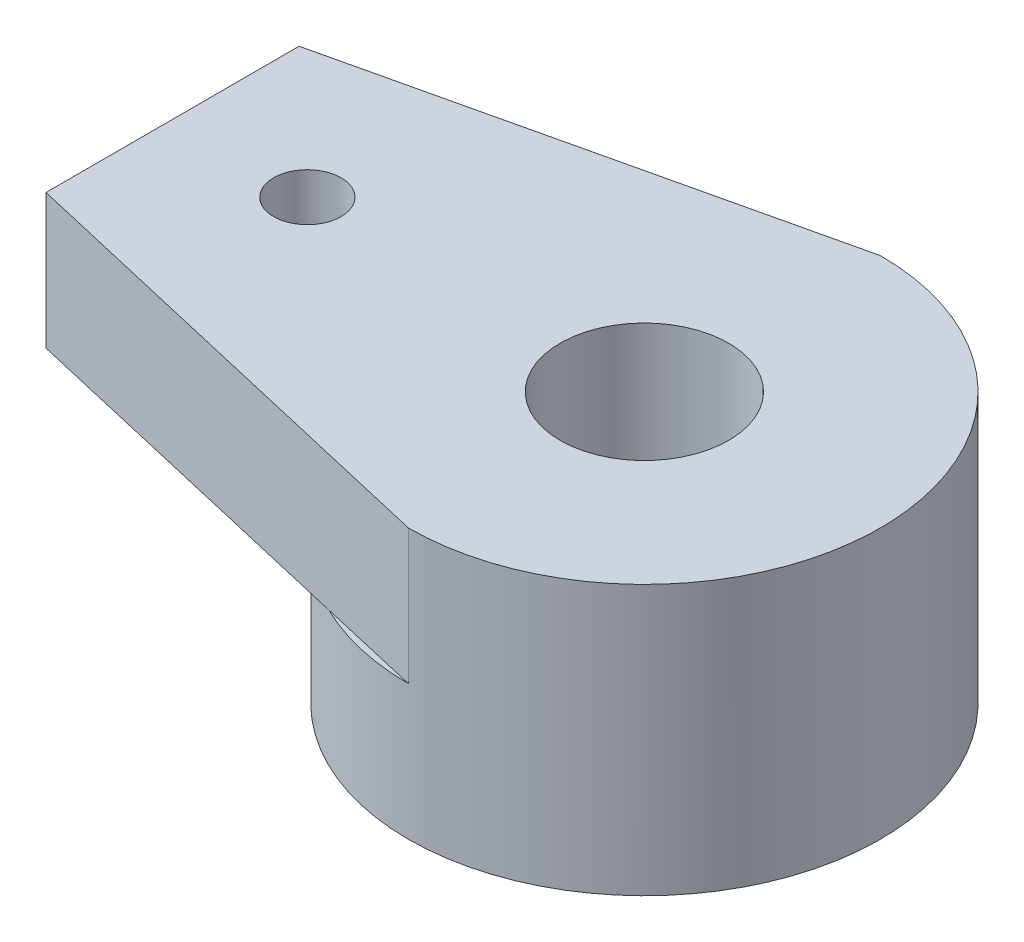
ISO-10303-21;
HEADER;
FILE_DESCRIPTION(('STEP AP214'),'2;1');
FILE_NAME('part.step','',(''),(''),'','','');
FILE_SCHEMA(('AUTOMOTIVE_DESIGN { 1 0 10303 214 1 1 1 1 }'));
ENDSEC;
DATA;
#1=APPLICATION_CONTEXT('core data for automotive mechanical design processes');
#2=APPLICATION_PROTOCOL_DEFINITION('international standard','automotive_design',2000,#1);
#3=PRODUCT_CONTEXT('',#1,'mechanical');
#4=PRODUCT('Part','Part','',(#3));
#5=PRODUCT_RELATED_PRODUCT_CATEGORY('part','',(#4));
#6=PRODUCT_DEFINITION_FORMATION('','',#4);
#7=PRODUCT_DEFINITION_CONTEXT('part definition',#1,'design');
#8=PRODUCT_DEFINITION('design','',#6,#7);
#9=PRODUCT_DEFINITION_SHAPE('','',#8);
#10=(LENGTH_UNIT() NAMED_UNIT(*) SI_UNIT(.MILLI.,.METRE.));
#11=(NAMED_UNIT(*) PLANE_ANGLE_UNIT() SI_UNIT($,.RADIAN.));
#12=(NAMED_UNIT(*) SI_UNIT($,.STERADIAN.) SOLID_ANGLE_UNIT());
#13=UNCERTAINTY_MEASURE_WITH_UNIT(LENGTH_MEASURE(1.E-05),#10,'distance_accuracy_value','');
#14=(GEOMETRIC_REPRESENTATION_CONTEXT(3) GLOBAL_UNCERTAINTY_ASSIGNED_CONTEXT((#13)) GLOBAL_UNIT_ASSIGNED_CONTEXT((#10,
#11,#12)) REPRESENTATION_CONTEXT('',''));
#15=CARTESIAN_POINT('',(0.,0.,0.));
#16=DIRECTION('',(0.,0.,1.));
#17=DIRECTION('',(1.,0.,0.));
#18=AXIS2_PLACEMENT_3D('',#15,#16,#17);
#19=CARTESIAN_POINT('',(0.,2.,0.));
#20=DIRECTION('',(0.,1.,0.));
#21=DIRECTION('',(0.,0.,1.));
#22=AXIS2_PLACEMENT_3D('',#19,#20,#21);
#23=PLANE('',#22);
#24=DIRECTION('',(0.974183305043496,0.,0.225758473095765));
#25=VECTOR('',#24,1.);
#26=CARTESIAN_POINT('',(-6.99907434633927,2.,1.87802564534532));
#27=LINE('',#26,#25);
#28=CARTESIAN_POINT('',(-1.53951094823404,2.,3.14323178277828));
#29=VERTEX_POINT('',#28);
#30=CARTESIAN_POINT('',(0.,2.,3.5));
#31=VERTEX_POINT('',#30);
#32=EDGE_CURVE('E11',#29,#31,#27,.T.);
#33=ORIENTED_EDGE('',*,*,#32,.F.);
#34=CARTESIAN_POINT('',(0.,2.,0.));
#35=DIRECTION('',(0.,1.,0.));
#36=DIRECTION('',(0.,0.,1.));
#37=AXIS2_PLACEMENT_3D('',#34,#35,#36);
#38=CIRCLE('',#37,3.5);
#39=EDGE_CURVE('E132',#29,#31,#38,.T.);
#40=ORIENTED_EDGE('',*,*,#39,.T.);
#41=EDGE_LOOP('',(#33,#40));
#42=FACE_BOUND('',#41,.T.);
#43=ADVANCED_FACE('F36',(#42),#23,.T.);
#44=DIRECTION('',(-0.974196433183722,0.,0.225701815615457));
#45=VECTOR('',#44,1.);
#46=CARTESIAN_POINT('',(-7.00092565366073,2.,-1.87802564534532));
#47=LINE('',#46,#45);
#48=CARTESIAN_POINT('',(0.,2.,-3.5));
#49=VERTEX_POINT('',#48);
#50=CARTESIAN_POINT('',(-1.53914532614968,2.,-3.1434108329952));
#51=VERTEX_POINT('',#50);
#52=EDGE_CURVE('E57',#49,#51,#47,.T.);
#53=ORIENTED_EDGE('',*,*,#52,.F.);
#54=EDGE_CURVE('E45',#49,#51,#38,.T.);
#55=ORIENTED_EDGE('',*,*,#54,.T.);
#56=EDGE_LOOP('',(#53,#55));
#57=FACE_BOUND('',#56,.T.);
#58=ADVANCED_FACE('F165',(#57),#23,.T.);
#59=CARTESIAN_POINT('',(0.,0.,0.));
#60=DIRECTION('',(0.,1.,0.));
#61=DIRECTION('',(0.,0.,1.));
#62=AXIS2_PLACEMENT_3D('',#59,#60,#61);
#63=PLANE('',#62);
#64=CARTESIAN_POINT('',(0.,0.,0.));
#65=DIRECTION('',(0.,1.,0.));
#66=DIRECTION('',(0.,0.,1.));
#67=AXIS2_PLACEMENT_3D('',#64,#65,#66);
#68=CIRCLE('',#67,3.5);
#69=CARTESIAN_POINT('',(0.,0.,3.5));
#70=VERTEX_POINT('',#69);
#71=EDGE_CURVE('E136',#70,#70,#68,.T.);
#72=ORIENTED_EDGE('',*,*,#71,.F.);
#73=EDGE_LOOP('',(#72));
#74=FACE_BOUND('',#73,.T.);
#75=CARTESIAN_POINT('',(0.,0.,0.));
#76=DIRECTION('',(0.,1.,0.));
#77=DIRECTION('',(0.,0.,1.));
#78=AXIS2_PLACEMENT_3D('',#75,#76,#77);
#79=CIRCLE('',#78,2.25);
#80=CARTESIAN_POINT('',(0.,0.,2.25));
#81=VERTEX_POINT('',#80);
#82=EDGE_CURVE('E110',#81,#81,#79,.T.);
#83=ORIENTED_EDGE('',*,*,#82,.T.);
#84=EDGE_LOOP('',(#83));
#85=FACE_BOUND('',#84,.T.);
#86=ADVANCED_FACE('F170',(#74,#85),#63,.F.);
#87=CARTESIAN_POINT('',(0.,2.,0.));
#88=DIRECTION('',(0.,-1.,0.));
#89=DIRECTION('',(0.,0.,-1.));
#90=AXIS2_PLACEMENT_3D('',#87,#88,#89);
#91=CYLINDRICAL_SURFACE('',#90,3.5);
#92=ORIENTED_EDGE('',*,*,#54,.F.);
#93=DIRECTION('',(0.,-1.,0.));
#94=VECTOR('',#93,1.);
#95=CARTESIAN_POINT('',(0.,4.,-3.5));
#96=LINE('',#95,#94);
#97=CARTESIAN_POINT('',(0.,4.,-3.5));
#98=VERTEX_POINT('',#97);
#99=EDGE_CURVE('E87',#98,#49,#96,.T.);
#100=ORIENTED_EDGE('',*,*,#99,.F.);
#101=CARTESIAN_POINT('',(0.,4.,0.));
#102=DIRECTION('',(0.,1.,0.));
#103=DIRECTION('',(0.,0.,1.));
#104=AXIS2_PLACEMENT_3D('',#101,#102,#103);
#105=CIRCLE('',#104,3.5);
#106=CARTESIAN_POINT('',(0.,4.,3.5));
#107=VERTEX_POINT('',#106);
#108=EDGE_CURVE('E93',#107,#98,#105,.T.);
#109=ORIENTED_EDGE('',*,*,#108,.F.);
#110=DIRECTION('',(0.,-1.,0.));
#111=VECTOR('',#110,1.);
#112=CARTESIAN_POINT('',(0.,4.,3.5));
#113=LINE('',#112,#111);
#114=EDGE_CURVE('E118',#107,#31,#113,.T.);
#115=ORIENTED_EDGE('',*,*,#114,.T.);
#116=ORIENTED_EDGE('',*,*,#39,.F.);
#117=EDGE_CURVE('E135',#51,#29,#38,.T.);
#118=ORIENTED_EDGE('',*,*,#117,.F.);
#119=EDGE_LOOP('',(#92,#100,#109,#115,#116,#118));
#120=FACE_BOUND('',#119,.T.);
#121=ORIENTED_EDGE('',*,*,#71,.T.);
#122=EDGE_LOOP('',(#121));
#123=FACE_BOUND('',#122,.T.);
#124=ADVANCED_FACE('F38',(#120,#123),#91,.T.);
#125=CARTESIAN_POINT('',(0.,2.,0.));
#126=DIRECTION('',(0.,-1.,0.));
#127=DIRECTION('',(0.,0.,-1.));
#128=AXIS2_PLACEMENT_3D('',#125,#126,#127);
#129=CYLINDRICAL_SURFACE('',#128,2.25);
#130=CARTESIAN_POINT('',(0.,2.,0.));
#131=DIRECTION('',(0.,1.,0.));
#132=DIRECTION('',(0.,0.,1.));
#133=AXIS2_PLACEMENT_3D('',#130,#131,#132);
#134=CIRCLE('',#133,2.25);
#135=CARTESIAN_POINT('',(0.,2.,2.25));
#136=VERTEX_POINT('',#135);
#137=EDGE_CURVE('E107',#136,#136,#134,.T.);
#138=ORIENTED_EDGE('',*,*,#137,.T.);
#139=EDGE_LOOP('',(#138));
#140=FACE_BOUND('',#139,.T.);
#141=ORIENTED_EDGE('',*,*,#82,.F.);
#142=EDGE_LOOP('',(#141));
#143=FACE_BOUND('',#142,.T.);
#144=ADVANCED_FACE('F172',(#140,#143),#129,.F.);
#145=CARTESIAN_POINT('',(0.,2.,0.));
#146=DIRECTION('',(0.,1.,0.));
#147=DIRECTION('',(0.,0.,1.));
#148=AXIS2_PLACEMENT_3D('',#145,#146,#147);
#149=PLANE('',#148);
#150=CARTESIAN_POINT('',(-5.,2.,0.));
#151=DIRECTION('',(0.,1.,0.));
#152=DIRECTION('',(0.,0.,1.));
#153=AXIS2_PLACEMENT_3D('',#150,#151,#152);
#154=CIRCLE('',#153,0.5);
#155=CARTESIAN_POINT('',(-5.,2.,0.5));
#156=VERTEX_POINT('',#155);
#157=EDGE_CURVE('E204',#156,#156,#154,.T.);
#158=ORIENTED_EDGE('',*,*,#157,.T.);
#159=EDGE_LOOP('',(#158));
#160=FACE_BOUND('',#159,.T.);
#161=CARTESIAN_POINT('',(-7.00092565366073,2.,-1.87802564534532));
#162=VERTEX_POINT('',#161);
#163=EDGE_CURVE('E123',#51,#162,#47,.T.);
#164=ORIENTED_EDGE('',*,*,#163,.F.);
#165=ORIENTED_EDGE('',*,*,#117,.T.);
#166=CARTESIAN_POINT('',(-6.99907434633927,2.,1.87802564534532));
#167=VERTEX_POINT('',#166);
#168=EDGE_CURVE('E103',#167,#29,#27,.T.);
#169=ORIENTED_EDGE('',*,*,#168,.F.);
#170=DIRECTION('',(0.000492886532507382,0.,0.999999878531426));
#171=VECTOR('',#170,1.);
#172=CARTESIAN_POINT('',(-7.00092565366073,2.,-1.87802564534532));
#173=LINE('',#172,#171);
#174=EDGE_CURVE('E127',#162,#167,#173,.T.);
#175=ORIENTED_EDGE('',*,*,#174,.F.);
#176=EDGE_LOOP('',(#164,#165,#169,#175));
#177=FACE_BOUND('',#176,.T.);
#178=ADVANCED_FACE('F147',(#160,#177),#149,.F.);
#179=CARTESIAN_POINT('',(0.,4.,0.));
#180=DIRECTION('',(0.,1.,0.));
#181=DIRECTION('',(0.,0.,1.));
#182=AXIS2_PLACEMENT_3D('',#179,#180,#181);
#183=PLANE('',#182);
#184=CARTESIAN_POINT('',(0.,4.,0.));
#185=DIRECTION('',(0.,1.,0.));
#186=DIRECTION('',(0.,0.,1.));
#187=AXIS2_PLACEMENT_3D('',#184,#185,#186);
#188=CIRCLE('',#187,1.25);
#189=CARTESIAN_POINT('',(0.,4.,1.25));
#190=VERTEX_POINT('',#189);
#191=EDGE_CURVE('E126',#190,#190,#188,.T.);
#192=ORIENTED_EDGE('',*,*,#191,.F.);
#193=EDGE_LOOP('',(#192));
#194=FACE_BOUND('',#193,.T.);
#195=ORIENTED_EDGE('',*,*,#108,.T.);
#196=DIRECTION('',(-0.974196433183722,0.,0.225701815615457));
#197=VECTOR('',#196,1.);
#198=CARTESIAN_POINT('',(-7.00092565366073,4.,-1.87802564534532));
#199=LINE('',#198,#197);
#200=CARTESIAN_POINT('',(-7.00092565366073,4.,-1.87802564534532));
#201=VERTEX_POINT('',#200);
#202=EDGE_CURVE('E83',#98,#201,#199,.T.);
#203=ORIENTED_EDGE('',*,*,#202,.T.);
#204=DIRECTION('',(0.000492886532507382,0.,0.999999878531426));
#205=VECTOR('',#204,1.);
#206=CARTESIAN_POINT('',(-7.00092565366073,4.,-1.87802564534532));
#207=LINE('',#206,#205);
#208=CARTESIAN_POINT('',(-6.99907434633927,4.,1.87802564534532));
#209=VERTEX_POINT('',#208);
#210=EDGE_CURVE('E92',#201,#209,#207,.T.);
#211=ORIENTED_EDGE('',*,*,#210,.T.);
#212=DIRECTION('',(0.974183305043496,0.,0.225758473095765));
#213=VECTOR('',#212,1.);
#214=CARTESIAN_POINT('',(-6.99907434633927,4.,1.87802564534532));
#215=LINE('',#214,#213);
#216=EDGE_CURVE('E99',#209,#107,#215,.T.);
#217=ORIENTED_EDGE('',*,*,#216,.T.);
#218=EDGE_LOOP('',(#195,#203,#211,#217));
#219=FACE_BOUND('',#218,.T.);
#220=CARTESIAN_POINT('',(-5.,4.,0.));
#221=DIRECTION('',(0.,1.,0.));
#222=DIRECTION('',(0.,0.,1.));
#223=AXIS2_PLACEMENT_3D('',#220,#221,#222);
#224=CIRCLE('',#223,0.5);
#225=CARTESIAN_POINT('',(-5.,4.,0.5));
#226=VERTEX_POINT('',#225);
#227=EDGE_CURVE('E199',#226,#226,#224,.T.);
#228=ORIENTED_EDGE('',*,*,#227,.F.);
#229=EDGE_LOOP('',(#228));
#230=FACE_BOUND('',#229,.T.);
#231=ADVANCED_FACE('F96',(#194,#219,#230),#183,.T.);
#232=ORIENTED_EDGE('',*,*,#137,.F.);
#233=EDGE_LOOP('',(#232));
#234=FACE_BOUND('',#233,.T.);
#235=CARTESIAN_POINT('',(0.,2.,0.));
#236=DIRECTION('',(0.,1.,0.));
#237=DIRECTION('',(0.,0.,1.));
#238=AXIS2_PLACEMENT_3D('',#235,#236,#237);
#239=CIRCLE('',#238,1.25);
#240=CARTESIAN_POINT('',(0.,2.,1.25));
#241=VERTEX_POINT('',#240);
#242=EDGE_CURVE('E197',#241,#241,#239,.T.);
#243=ORIENTED_EDGE('',*,*,#242,.T.);
#244=EDGE_LOOP('',(#243));
#245=FACE_BOUND('',#244,.T.);
#246=ADVANCED_FACE('F162',(#234,#245),#149,.F.);
#247=CARTESIAN_POINT('',(-7.00092565366073,4.,-1.87802564534532));
#248=DIRECTION('',(0.225701815615457,0.,0.974196433183722));
#249=DIRECTION('',(0.974196433183722,0.,-0.225701815615457));
#250=AXIS2_PLACEMENT_3D('',#247,#248,#249);
#251=PLANE('',#250);
#252=ORIENTED_EDGE('',*,*,#52,.T.);
#253=ORIENTED_EDGE('',*,*,#163,.T.);
#254=DIRECTION('',(0.,-1.,0.));
#255=VECTOR('',#254,1.);
#256=CARTESIAN_POINT('',(-7.00092565366073,4.,-1.87802564534532));
#257=LINE('',#256,#255);
#258=EDGE_CURVE('E89',#201,#162,#257,.T.);
#259=ORIENTED_EDGE('',*,*,#258,.F.);
#260=ORIENTED_EDGE('',*,*,#202,.F.);
#261=ORIENTED_EDGE('',*,*,#99,.T.);
#262=EDGE_LOOP('',(#252,#253,#259,#260,#261));
#263=FACE_BOUND('',#262,.T.);
#264=ADVANCED_FACE('F85',(#263),#251,.F.);
#265=CARTESIAN_POINT('',(-7.00092565366073,4.,-1.87802564534532));
#266=DIRECTION('',(0.999999878531426,0.,-0.000492886532507382));
#267=DIRECTION('',(-0.000492886532507382,0.,-0.999999878531426));
#268=AXIS2_PLACEMENT_3D('',#265,#266,#267);
#269=PLANE('',#268);
#270=ORIENTED_EDGE('',*,*,#174,.T.);
#271=DIRECTION('',(0.,-1.,0.));
#272=VECTOR('',#271,1.);
#273=CARTESIAN_POINT('',(-6.99907434633927,4.,1.87802564534532));
#274=LINE('',#273,#272);
#275=EDGE_CURVE('E112',#209,#167,#274,.T.);
#276=ORIENTED_EDGE('',*,*,#275,.F.);
#277=ORIENTED_EDGE('',*,*,#210,.F.);
#278=ORIENTED_EDGE('',*,*,#258,.T.);
#279=EDGE_LOOP('',(#270,#276,#277,#278));
#280=FACE_BOUND('',#279,.T.);
#281=ADVANCED_FACE('F153',(#280),#269,.F.);
#282=CARTESIAN_POINT('',(-6.99907434633927,4.,1.87802564534532));
#283=DIRECTION('',(0.225758473095765,0.,-0.974183305043496));
#284=DIRECTION('',(-0.974183305043496,0.,-0.225758473095765));
#285=AXIS2_PLACEMENT_3D('',#282,#283,#284);
#286=PLANE('',#285);
#287=ORIENTED_EDGE('',*,*,#168,.T.);
#288=ORIENTED_EDGE('',*,*,#32,.T.);
#289=ORIENTED_EDGE('',*,*,#114,.F.);
#290=ORIENTED_EDGE('',*,*,#216,.F.);
#291=ORIENTED_EDGE('',*,*,#275,.T.);
#292=EDGE_LOOP('',(#287,#288,#289,#290,#291));
#293=FACE_BOUND('',#292,.T.);
#294=ADVANCED_FACE('F150',(#293),#286,.F.);
#295=CARTESIAN_POINT('',(0.,4.,0.));
#296=DIRECTION('',(0.,-1.,0.));
#297=DIRECTION('',(0.,0.,-1.));
#298=AXIS2_PLACEMENT_3D('',#295,#296,#297);
#299=CYLINDRICAL_SURFACE('',#298,1.25);
#300=ORIENTED_EDGE('',*,*,#191,.T.);
#301=EDGE_LOOP('',(#300));
#302=FACE_BOUND('',#301,.T.);
#303=ORIENTED_EDGE('',*,*,#242,.F.);
#304=EDGE_LOOP('',(#303));
#305=FACE_BOUND('',#304,.T.);
#306=ADVANCED_FACE('F160',(#302,#305),#299,.F.);
#307=CARTESIAN_POINT('',(-5.,4.,0.));
#308=DIRECTION('',(0.,-1.,0.));
#309=DIRECTION('',(0.,0.,-1.));
#310=AXIS2_PLACEMENT_3D('',#307,#308,#309);
#311=CYLINDRICAL_SURFACE('',#310,0.5);
#312=ORIENTED_EDGE('',*,*,#227,.T.);
#313=EDGE_LOOP('',(#312));
#314=FACE_BOUND('',#313,.T.);
#315=ORIENTED_EDGE('',*,*,#157,.F.);
#316=EDGE_LOOP('',(#315));
#317=FACE_BOUND('',#316,.T.);
#318=ADVANCED_FACE('F210',(#314,#317),#311,.F.);
#319=CLOSED_SHELL('',(#43,#58,#86,#124,#144,#178,#231,#246,#264,#281,#294,#306,#318));
#320=MANIFOLD_SOLID_BREP('B2',#319);
#321=ADVANCED_BREP_SHAPE_REPRESENTATION('',(#18,#320),#14);
#322=SHAPE_DEFINITION_REPRESENTATION(#9,#321);
ENDSEC;
END-ISO-10303-21;
